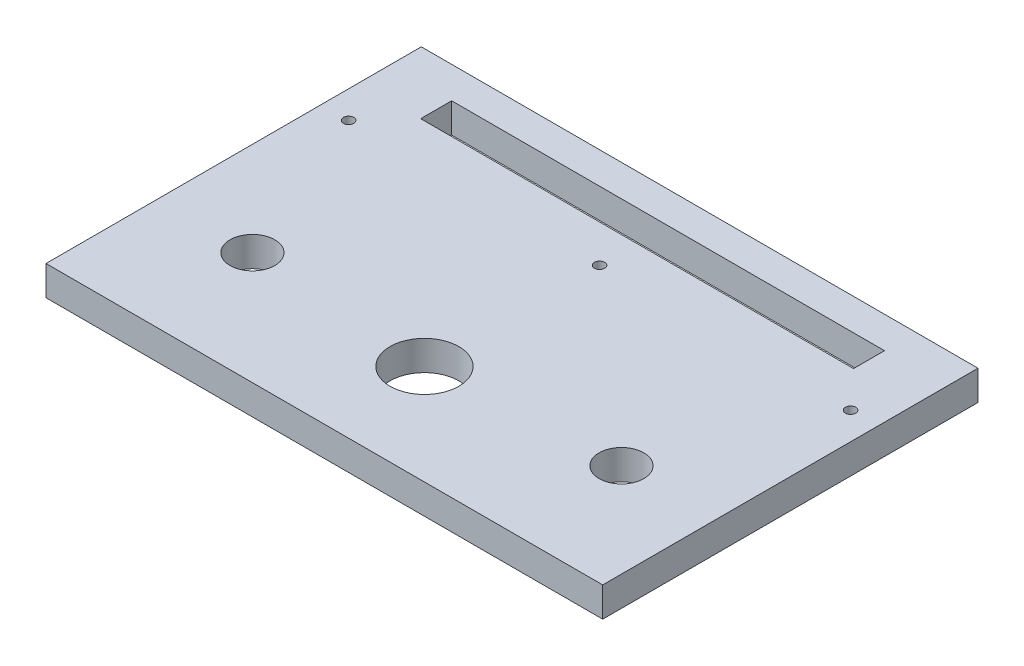
ISO-10303-21;
HEADER;
FILE_DESCRIPTION(('STEP AP214'),'2;1');
FILE_NAME('part.step','',(''),(''),'','','');
FILE_SCHEMA(('AUTOMOTIVE_DESIGN { 1 0 10303 214 1 1 1 1 }'));
ENDSEC;
DATA;
#1=APPLICATION_CONTEXT('core data for automotive mechanical design processes');
#2=APPLICATION_PROTOCOL_DEFINITION('international standard','automotive_design',2000,#1);
#3=PRODUCT_CONTEXT('',#1,'mechanical');
#4=PRODUCT('Part','Part','',(#3));
#5=PRODUCT_RELATED_PRODUCT_CATEGORY('part','',(#4));
#6=PRODUCT_DEFINITION_FORMATION('','',#4);
#7=PRODUCT_DEFINITION_CONTEXT('part definition',#1,'design');
#8=PRODUCT_DEFINITION('design','',#6,#7);
#9=PRODUCT_DEFINITION_SHAPE('','',#8);
#10=(LENGTH_UNIT() NAMED_UNIT(*) SI_UNIT(.MILLI.,.METRE.));
#11=(NAMED_UNIT(*) PLANE_ANGLE_UNIT() SI_UNIT($,.RADIAN.));
#12=(NAMED_UNIT(*) SI_UNIT($,.STERADIAN.) SOLID_ANGLE_UNIT());
#13=UNCERTAINTY_MEASURE_WITH_UNIT(LENGTH_MEASURE(1.E-05),#10,'distance_accuracy_value','');
#14=(GEOMETRIC_REPRESENTATION_CONTEXT(3) GLOBAL_UNCERTAINTY_ASSIGNED_CONTEXT((#13)) GLOBAL_UNIT_ASSIGNED_CONTEXT((#10,
#11,#12)) REPRESENTATION_CONTEXT('',''));
#15=CARTESIAN_POINT('',(0.,0.,0.));
#16=DIRECTION('',(0.,0.,1.));
#17=DIRECTION('',(1.,0.,0.));
#18=AXIS2_PLACEMENT_3D('',#15,#16,#17);
#19=CARTESIAN_POINT('',(0.,9.5,0.));
#20=DIRECTION('',(0.,1.,0.));
#21=DIRECTION('',(0.,0.,1.));
#22=AXIS2_PLACEMENT_3D('',#19,#20,#21);
#23=PLANE('',#22);
#24=CARTESIAN_POINT('',(-80.25,9.5,-28.));
#25=DIRECTION('',(0.,1.,0.));
#26=DIRECTION('',(0.,0.,1.));
#27=AXIS2_PLACEMENT_3D('',#24,#25,#26);
#28=CIRCLE('',#27,1.64999999999998);
#29=CARTESIAN_POINT('',(-80.25,9.5,-26.35));
#30=VERTEX_POINT('',#29);
#31=EDGE_CURVE('E281',#30,#30,#28,.T.);
#32=ORIENTED_EDGE('',*,*,#31,.F.);
#33=EDGE_LOOP('',(#32));
#34=FACE_BOUND('',#33,.T.);
#35=CARTESIAN_POINT('',(0.,9.5,-28.));
#36=DIRECTION('',(0.,1.,0.));
#37=DIRECTION('',(0.,0.,1.));
#38=AXIS2_PLACEMENT_3D('',#35,#36,#37);
#39=CIRCLE('',#38,1.64999999999999);
#40=CARTESIAN_POINT('',(0.,9.5,-26.35));
#41=VERTEX_POINT('',#40);
#42=EDGE_CURVE('E285',#41,#41,#39,.T.);
#43=ORIENTED_EDGE('',*,*,#42,.F.);
#44=EDGE_LOOP('',(#43));
#45=FACE_BOUND('',#44,.T.);
#46=CARTESIAN_POINT('',(80.25,9.5,-28.));
#47=DIRECTION('',(0.,1.,0.));
#48=DIRECTION('',(0.,0.,1.));
#49=AXIS2_PLACEMENT_3D('',#46,#47,#48);
#50=CIRCLE('',#49,1.64999999999998);
#51=CARTESIAN_POINT('',(80.25,9.5,-26.35));
#52=VERTEX_POINT('',#51);
#53=EDGE_CURVE('E295',#52,#52,#50,.T.);
#54=ORIENTED_EDGE('',*,*,#53,.F.);
#55=EDGE_LOOP('',(#54));
#56=FACE_BOUND('',#55,.T.);
#57=CARTESIAN_POINT('',(-59.,9.5,24.));
#58=DIRECTION('',(0.,1.,0.));
#59=DIRECTION('',(0.,0.,1.));
#60=AXIS2_PLACEMENT_3D('',#57,#58,#59);
#61=CIRCLE('',#60,7.15000000000001);
#62=CARTESIAN_POINT('',(-59.,9.5,31.15));
#63=VERTEX_POINT('',#62);
#64=EDGE_CURVE('E312',#63,#63,#61,.T.);
#65=ORIENTED_EDGE('',*,*,#64,.F.);
#66=EDGE_LOOP('',(#65));
#67=FACE_BOUND('',#66,.T.);
#68=DIRECTION('',(-1.,0.,0.));
#69=VECTOR('',#68,1.);
#70=CARTESIAN_POINT('',(69.2,9.5,-49.9));
#71=LINE('',#70,#69);
#72=CARTESIAN_POINT('',(69.2,9.5,-49.9));
#73=VERTEX_POINT('',#72);
#74=CARTESIAN_POINT('',(-69.2,9.5,-49.9));
#75=VERTEX_POINT('',#74);
#76=EDGE_CURVE('E118',#73,#75,#71,.T.);
#77=ORIENTED_EDGE('',*,*,#76,.F.);
#78=DIRECTION('',(0.,0.,-1.));
#79=VECTOR('',#78,1.);
#80=CARTESIAN_POINT('',(69.2,9.5,-40.));
#81=LINE('',#80,#79);
#82=CARTESIAN_POINT('',(69.2,9.5,-40.));
#83=VERTEX_POINT('',#82);
#84=EDGE_CURVE('E109',#83,#73,#81,.T.);
#85=ORIENTED_EDGE('',*,*,#84,.F.);
#86=DIRECTION('',(1.,0.,0.));
#87=VECTOR('',#86,1.);
#88=CARTESIAN_POINT('',(-69.2,9.5,-40.));
#89=LINE('',#88,#87);
#90=CARTESIAN_POINT('',(-69.2,9.5,-40.));
#91=VERTEX_POINT('',#90);
#92=EDGE_CURVE('E136',#91,#83,#89,.T.);
#93=ORIENTED_EDGE('',*,*,#92,.F.);
#94=DIRECTION('',(0.,0.,1.));
#95=VECTOR('',#94,1.);
#96=CARTESIAN_POINT('',(-69.2,9.5,-49.9));
#97=LINE('',#96,#95);
#98=EDGE_CURVE('E132',#75,#91,#97,.T.);
#99=ORIENTED_EDGE('',*,*,#98,.F.);
#100=EDGE_LOOP('',(#77,#85,#93,#99));
#101=FACE_BOUND('',#100,.T.);
#102=DIRECTION('',(0.,0.,-1.));
#103=VECTOR('',#102,1.);
#104=CARTESIAN_POINT('',(89.,9.5,-60.));
#105=LINE('',#104,#103);
#106=CARTESIAN_POINT('',(89.,9.5,60.));
#107=VERTEX_POINT('',#106);
#108=CARTESIAN_POINT('',(89.,9.5,-60.));
#109=VERTEX_POINT('',#108);
#110=EDGE_CURVE('E160',#107,#109,#105,.T.);
#111=ORIENTED_EDGE('',*,*,#110,.T.);
#112=DIRECTION('',(-1.,0.,0.));
#113=VECTOR('',#112,1.);
#114=CARTESIAN_POINT('',(-89.,9.5,-60.));
#115=LINE('',#114,#113);
#116=CARTESIAN_POINT('',(-89.,9.5,-60.));
#117=VERTEX_POINT('',#116);
#118=EDGE_CURVE('E164',#109,#117,#115,.T.);
#119=ORIENTED_EDGE('',*,*,#118,.T.);
#120=DIRECTION('',(0.,0.,1.));
#121=VECTOR('',#120,1.);
#122=CARTESIAN_POINT('',(-89.,9.5,-60.));
#123=LINE('',#122,#121);
#124=CARTESIAN_POINT('',(-89.,9.5,60.));
#125=VERTEX_POINT('',#124);
#126=EDGE_CURVE('E168',#117,#125,#123,.T.);
#127=ORIENTED_EDGE('',*,*,#126,.T.);
#128=DIRECTION('',(1.,0.,0.));
#129=VECTOR('',#128,1.);
#130=CARTESIAN_POINT('',(-89.,9.5,60.));
#131=LINE('',#130,#129);
#132=EDGE_CURVE('E171',#125,#107,#131,.T.);
#133=ORIENTED_EDGE('',*,*,#132,.T.);
#134=EDGE_LOOP('',(#111,#119,#127,#133));
#135=FACE_BOUND('',#134,.T.);
#136=CARTESIAN_POINT('',(0.,9.5,28.));
#137=DIRECTION('',(0.,1.,0.));
#138=DIRECTION('',(0.,0.,1.));
#139=AXIS2_PLACEMENT_3D('',#136,#137,#138);
#140=CIRCLE('',#139,11.);
#141=CARTESIAN_POINT('',(0.,9.5,39.));
#142=VERTEX_POINT('',#141);
#143=EDGE_CURVE('E144',#142,#142,#140,.T.);
#144=ORIENTED_EDGE('',*,*,#143,.F.);
#145=EDGE_LOOP('',(#144));
#146=FACE_BOUND('',#145,.T.);
#147=CARTESIAN_POINT('',(59.,9.5,24.));
#148=DIRECTION('',(0.,1.,0.));
#149=DIRECTION('',(0.,0.,-1.));
#150=AXIS2_PLACEMENT_3D('',#147,#148,#149);
#151=CIRCLE('',#150,7.15000000000001);
#152=CARTESIAN_POINT('',(59.,9.5,16.85));
#153=VERTEX_POINT('',#152);
#154=EDGE_CURVE('E304',#153,#153,#151,.T.);
#155=ORIENTED_EDGE('',*,*,#154,.F.);
#156=EDGE_LOOP('',(#155));
#157=FACE_BOUND('',#156,.T.);
#158=ADVANCED_FACE('F43',(#34,#45,#56,#67,#101,#135,#146,#157),#23,.T.);
#159=CARTESIAN_POINT('',(0.,0.,0.));
#160=DIRECTION('',(0.,1.,0.));
#161=DIRECTION('',(0.,0.,1.));
#162=AXIS2_PLACEMENT_3D('',#159,#160,#161);
#163=PLANE('',#162);
#164=CARTESIAN_POINT('',(-80.25,0.,-28.));
#165=DIRECTION('',(0.,1.,0.));
#166=DIRECTION('',(0.,0.,1.));
#167=AXIS2_PLACEMENT_3D('',#164,#165,#166);
#168=CIRCLE('',#167,1.65);
#169=CARTESIAN_POINT('',(-80.25,0.,-26.35));
#170=VERTEX_POINT('',#169);
#171=EDGE_CURVE('E279',#170,#170,#168,.T.);
#172=ORIENTED_EDGE('',*,*,#171,.T.);
#173=EDGE_LOOP('',(#172));
#174=FACE_BOUND('',#173,.T.);
#175=CARTESIAN_POINT('',(0.,0.,-28.));
#176=DIRECTION('',(0.,1.,0.));
#177=DIRECTION('',(0.,0.,1.));
#178=AXIS2_PLACEMENT_3D('',#175,#176,#177);
#179=CIRCLE('',#178,1.65);
#180=CARTESIAN_POINT('',(0.,0.,-26.35));
#181=VERTEX_POINT('',#180);
#182=EDGE_CURVE('E291',#181,#181,#179,.T.);
#183=ORIENTED_EDGE('',*,*,#182,.T.);
#184=EDGE_LOOP('',(#183));
#185=FACE_BOUND('',#184,.T.);
#186=CARTESIAN_POINT('',(80.25,0.,-28.));
#187=DIRECTION('',(0.,1.,0.));
#188=DIRECTION('',(0.,0.,1.));
#189=AXIS2_PLACEMENT_3D('',#186,#187,#188);
#190=CIRCLE('',#189,1.65);
#191=CARTESIAN_POINT('',(80.25,0.,-26.35));
#192=VERTEX_POINT('',#191);
#193=EDGE_CURVE('E299',#192,#192,#190,.T.);
#194=ORIENTED_EDGE('',*,*,#193,.T.);
#195=EDGE_LOOP('',(#194));
#196=FACE_BOUND('',#195,.T.);
#197=DIRECTION('',(0.,0.,-1.));
#198=VECTOR('',#197,1.);
#199=CARTESIAN_POINT('',(89.,0.,-60.));
#200=LINE('',#199,#198);
#201=CARTESIAN_POINT('',(89.,0.,60.));
#202=VERTEX_POINT('',#201);
#203=CARTESIAN_POINT('',(89.,0.,-60.));
#204=VERTEX_POINT('',#203);
#205=EDGE_CURVE('E127',#202,#204,#200,.T.);
#206=ORIENTED_EDGE('',*,*,#205,.F.);
#207=DIRECTION('',(1.,0.,0.));
#208=VECTOR('',#207,1.);
#209=CARTESIAN_POINT('',(-89.,0.,60.));
#210=LINE('',#209,#208);
#211=CARTESIAN_POINT('',(-89.,0.,60.));
#212=VERTEX_POINT('',#211);
#213=EDGE_CURVE('E165',#212,#202,#210,.T.);
#214=ORIENTED_EDGE('',*,*,#213,.F.);
#215=DIRECTION('',(0.,0.,1.));
#216=VECTOR('',#215,1.);
#217=CARTESIAN_POINT('',(-89.,0.,-60.));
#218=LINE('',#217,#216);
#219=CARTESIAN_POINT('',(-89.,0.,-60.));
#220=VERTEX_POINT('',#219);
#221=EDGE_CURVE('E181',#220,#212,#218,.T.);
#222=ORIENTED_EDGE('',*,*,#221,.F.);
#223=DIRECTION('',(-1.,0.,0.));
#224=VECTOR('',#223,1.);
#225=CARTESIAN_POINT('',(-89.,0.,-60.));
#226=LINE('',#225,#224);
#227=EDGE_CURVE('E178',#204,#220,#226,.T.);
#228=ORIENTED_EDGE('',*,*,#227,.F.);
#229=EDGE_LOOP('',(#206,#214,#222,#228));
#230=FACE_BOUND('',#229,.T.);
#231=DIRECTION('',(0.,0.,-1.));
#232=VECTOR('',#231,1.);
#233=CARTESIAN_POINT('',(69.2,0.,-40.));
#234=LINE('',#233,#232);
#235=CARTESIAN_POINT('',(69.2,0.,-40.));
#236=VERTEX_POINT('',#235);
#237=CARTESIAN_POINT('',(69.2,0.,-49.9));
#238=VERTEX_POINT('',#237);
#239=EDGE_CURVE('E67',#236,#238,#234,.T.);
#240=ORIENTED_EDGE('',*,*,#239,.T.);
#241=DIRECTION('',(-1.,0.,0.));
#242=VECTOR('',#241,1.);
#243=CARTESIAN_POINT('',(69.2,0.,-49.9));
#244=LINE('',#243,#242);
#245=CARTESIAN_POINT('',(-69.2,0.,-49.9));
#246=VERTEX_POINT('',#245);
#247=EDGE_CURVE('E125',#238,#246,#244,.T.);
#248=ORIENTED_EDGE('',*,*,#247,.T.);
#249=DIRECTION('',(0.,0.,1.));
#250=VECTOR('',#249,1.);
#251=CARTESIAN_POINT('',(-69.2,0.,-49.9));
#252=LINE('',#251,#250);
#253=CARTESIAN_POINT('',(-69.2,0.,-40.));
#254=VERTEX_POINT('',#253);
#255=EDGE_CURVE('E147',#246,#254,#252,.T.);
#256=ORIENTED_EDGE('',*,*,#255,.T.);
#257=DIRECTION('',(1.,0.,0.));
#258=VECTOR('',#257,1.);
#259=CARTESIAN_POINT('',(-69.2,0.,-40.));
#260=LINE('',#259,#258);
#261=EDGE_CURVE('E119',#254,#236,#260,.T.);
#262=ORIENTED_EDGE('',*,*,#261,.T.);
#263=EDGE_LOOP('',(#240,#248,#256,#262));
#264=FACE_BOUND('',#263,.T.);
#265=CARTESIAN_POINT('',(0.,0.,28.));
#266=DIRECTION('',(0.,1.,0.));
#267=DIRECTION('',(0.,0.,1.));
#268=AXIS2_PLACEMENT_3D('',#265,#266,#267);
#269=CIRCLE('',#268,11.);
#270=CARTESIAN_POINT('',(0.,0.,39.));
#271=VERTEX_POINT('',#270);
#272=EDGE_CURVE('E316',#271,#271,#269,.T.);
#273=ORIENTED_EDGE('',*,*,#272,.T.);
#274=EDGE_LOOP('',(#273));
#275=FACE_BOUND('',#274,.T.);
#276=CARTESIAN_POINT('',(-59.,0.,24.));
#277=DIRECTION('',(0.,1.,0.));
#278=DIRECTION('',(0.,0.,1.));
#279=AXIS2_PLACEMENT_3D('',#276,#277,#278);
#280=CIRCLE('',#279,7.15000000000001);
#281=CARTESIAN_POINT('',(-59.,0.,31.15));
#282=VERTEX_POINT('',#281);
#283=EDGE_CURVE('E308',#282,#282,#280,.T.);
#284=ORIENTED_EDGE('',*,*,#283,.T.);
#285=EDGE_LOOP('',(#284));
#286=FACE_BOUND('',#285,.T.);
#287=CARTESIAN_POINT('',(59.,0.,24.));
#288=DIRECTION('',(0.,1.,0.));
#289=DIRECTION('',(0.,0.,-1.));
#290=AXIS2_PLACEMENT_3D('',#287,#288,#289);
#291=CIRCLE('',#290,7.15000000000001);
#292=CARTESIAN_POINT('',(59.,0.,16.85));
#293=VERTEX_POINT('',#292);
#294=EDGE_CURVE('E303',#293,#293,#291,.T.);
#295=ORIENTED_EDGE('',*,*,#294,.T.);
#296=EDGE_LOOP('',(#295));
#297=FACE_BOUND('',#296,.T.);
#298=ADVANCED_FACE('F204',(#174,#185,#196,#230,#264,#275,#286,#297),#163,.F.);
#299=CARTESIAN_POINT('',(89.,9.5,-60.));
#300=DIRECTION('',(-1.,0.,0.));
#301=DIRECTION('',(0.,0.,1.));
#302=AXIS2_PLACEMENT_3D('',#299,#300,#301);
#303=PLANE('',#302);
#304=ORIENTED_EDGE('',*,*,#205,.T.);
#305=DIRECTION('',(0.,-1.,0.));
#306=VECTOR('',#305,1.);
#307=CARTESIAN_POINT('',(89.,9.5,-60.));
#308=LINE('',#307,#306);
#309=EDGE_CURVE('E11',#109,#204,#308,.T.);
#310=ORIENTED_EDGE('',*,*,#309,.F.);
#311=ORIENTED_EDGE('',*,*,#110,.F.);
#312=DIRECTION('',(0.,-1.,0.));
#313=VECTOR('',#312,1.);
#314=CARTESIAN_POINT('',(89.,9.5,60.));
#315=LINE('',#314,#313);
#316=EDGE_CURVE('E174',#107,#202,#315,.T.);
#317=ORIENTED_EDGE('',*,*,#316,.T.);
#318=EDGE_LOOP('',(#304,#310,#311,#317));
#319=FACE_BOUND('',#318,.T.);
#320=ADVANCED_FACE('F45',(#319),#303,.F.);
#321=CARTESIAN_POINT('',(-89.,9.5,-60.));
#322=DIRECTION('',(0.,0.,1.));
#323=DIRECTION('',(1.,0.,0.));
#324=AXIS2_PLACEMENT_3D('',#321,#322,#323);
#325=PLANE('',#324);
#326=ORIENTED_EDGE('',*,*,#227,.T.);
#327=DIRECTION('',(0.,-1.,0.));
#328=VECTOR('',#327,1.);
#329=CARTESIAN_POINT('',(-89.,9.5,-60.));
#330=LINE('',#329,#328);
#331=EDGE_CURVE('E52',#117,#220,#330,.T.);
#332=ORIENTED_EDGE('',*,*,#331,.F.);
#333=ORIENTED_EDGE('',*,*,#118,.F.);
#334=ORIENTED_EDGE('',*,*,#309,.T.);
#335=EDGE_LOOP('',(#326,#332,#333,#334));
#336=FACE_BOUND('',#335,.T.);
#337=ADVANCED_FACE('F214',(#336),#325,.F.);
#338=CARTESIAN_POINT('',(-89.,9.5,-60.));
#339=DIRECTION('',(1.,0.,0.));
#340=DIRECTION('',(0.,0.,-1.));
#341=AXIS2_PLACEMENT_3D('',#338,#339,#340);
#342=PLANE('',#341);
#343=ORIENTED_EDGE('',*,*,#221,.T.);
#344=DIRECTION('',(0.,-1.,0.));
#345=VECTOR('',#344,1.);
#346=CARTESIAN_POINT('',(-89.,9.5,60.));
#347=LINE('',#346,#345);
#348=EDGE_CURVE('E189',#125,#212,#347,.T.);
#349=ORIENTED_EDGE('',*,*,#348,.F.);
#350=ORIENTED_EDGE('',*,*,#126,.F.);
#351=ORIENTED_EDGE('',*,*,#331,.T.);
#352=EDGE_LOOP('',(#343,#349,#350,#351));
#353=FACE_BOUND('',#352,.T.);
#354=ADVANCED_FACE('F198',(#353),#342,.F.);
#355=CARTESIAN_POINT('',(-89.,9.5,60.));
#356=DIRECTION('',(0.,0.,-1.));
#357=DIRECTION('',(-1.,0.,0.));
#358=AXIS2_PLACEMENT_3D('',#355,#356,#357);
#359=PLANE('',#358);
#360=ORIENTED_EDGE('',*,*,#213,.T.);
#361=ORIENTED_EDGE('',*,*,#316,.F.);
#362=ORIENTED_EDGE('',*,*,#132,.F.);
#363=ORIENTED_EDGE('',*,*,#348,.T.);
#364=EDGE_LOOP('',(#360,#361,#362,#363));
#365=FACE_BOUND('',#364,.T.);
#366=ADVANCED_FACE('F208',(#365),#359,.F.);
#367=CARTESIAN_POINT('',(69.2,9.5,-40.));
#368=DIRECTION('',(-1.,0.,0.));
#369=DIRECTION('',(0.,0.,1.));
#370=AXIS2_PLACEMENT_3D('',#367,#368,#369);
#371=PLANE('',#370);
#372=ORIENTED_EDGE('',*,*,#239,.F.);
#373=DIRECTION('',(0.,-1.,0.));
#374=VECTOR('',#373,1.);
#375=CARTESIAN_POINT('',(69.2,9.5,-40.));
#376=LINE('',#375,#374);
#377=EDGE_CURVE('E113',#83,#236,#376,.T.);
#378=ORIENTED_EDGE('',*,*,#377,.F.);
#379=ORIENTED_EDGE('',*,*,#84,.T.);
#380=DIRECTION('',(0.,-1.,0.));
#381=VECTOR('',#380,1.);
#382=CARTESIAN_POINT('',(69.2,9.5,-49.9));
#383=LINE('',#382,#381);
#384=EDGE_CURVE('E112',#73,#238,#383,.T.);
#385=ORIENTED_EDGE('',*,*,#384,.T.);
#386=EDGE_LOOP('',(#372,#378,#379,#385));
#387=FACE_BOUND('',#386,.T.);
#388=ADVANCED_FACE('F111',(#387),#371,.T.);
#389=CARTESIAN_POINT('',(69.2,9.5,-49.9));
#390=DIRECTION('',(0.,0.,1.));
#391=DIRECTION('',(1.,0.,0.));
#392=AXIS2_PLACEMENT_3D('',#389,#390,#391);
#393=PLANE('',#392);
#394=ORIENTED_EDGE('',*,*,#247,.F.);
#395=ORIENTED_EDGE('',*,*,#384,.F.);
#396=ORIENTED_EDGE('',*,*,#76,.T.);
#397=DIRECTION('',(0.,-1.,0.));
#398=VECTOR('',#397,1.);
#399=CARTESIAN_POINT('',(-69.2,9.5,-49.9));
#400=LINE('',#399,#398);
#401=EDGE_CURVE('E128',#75,#246,#400,.T.);
#402=ORIENTED_EDGE('',*,*,#401,.T.);
#403=EDGE_LOOP('',(#394,#395,#396,#402));
#404=FACE_BOUND('',#403,.T.);
#405=ADVANCED_FACE('F122',(#404),#393,.T.);
#406=CARTESIAN_POINT('',(-69.2,9.5,-49.9));
#407=DIRECTION('',(1.,0.,0.));
#408=DIRECTION('',(0.,0.,-1.));
#409=AXIS2_PLACEMENT_3D('',#406,#407,#408);
#410=PLANE('',#409);
#411=ORIENTED_EDGE('',*,*,#255,.F.);
#412=ORIENTED_EDGE('',*,*,#401,.F.);
#413=ORIENTED_EDGE('',*,*,#98,.T.);
#414=DIRECTION('',(0.,-1.,0.));
#415=VECTOR('',#414,1.);
#416=CARTESIAN_POINT('',(-69.2,9.5,-40.));
#417=LINE('',#416,#415);
#418=EDGE_CURVE('E59',#91,#254,#417,.T.);
#419=ORIENTED_EDGE('',*,*,#418,.T.);
#420=EDGE_LOOP('',(#411,#412,#413,#419));
#421=FACE_BOUND('',#420,.T.);
#422=ADVANCED_FACE('F241',(#421),#410,.T.);
#423=CARTESIAN_POINT('',(-69.2,9.5,-40.));
#424=DIRECTION('',(0.,0.,-1.));
#425=DIRECTION('',(-1.,0.,0.));
#426=AXIS2_PLACEMENT_3D('',#423,#424,#425);
#427=PLANE('',#426);
#428=ORIENTED_EDGE('',*,*,#261,.F.);
#429=ORIENTED_EDGE('',*,*,#418,.F.);
#430=ORIENTED_EDGE('',*,*,#92,.T.);
#431=ORIENTED_EDGE('',*,*,#377,.T.);
#432=EDGE_LOOP('',(#428,#429,#430,#431));
#433=FACE_BOUND('',#432,.T.);
#434=ADVANCED_FACE('F245',(#433),#427,.T.);
#435=CARTESIAN_POINT('',(0.,9.5,28.));
#436=DIRECTION('',(0.,-1.,0.));
#437=DIRECTION('',(0.,0.,-1.));
#438=AXIS2_PLACEMENT_3D('',#435,#436,#437);
#439=CYLINDRICAL_SURFACE('',#438,11.);
#440=ORIENTED_EDGE('',*,*,#143,.T.);
#441=EDGE_LOOP('',(#440));
#442=FACE_BOUND('',#441,.T.);
#443=ORIENTED_EDGE('',*,*,#272,.F.);
#444=EDGE_LOOP('',(#443));
#445=FACE_BOUND('',#444,.T.);
#446=ADVANCED_FACE('F251',(#442,#445),#439,.F.);
#447=CARTESIAN_POINT('',(-59.,9.5,24.));
#448=DIRECTION('',(0.,-1.,0.));
#449=DIRECTION('',(0.,0.,-1.));
#450=AXIS2_PLACEMENT_3D('',#447,#448,#449);
#451=CYLINDRICAL_SURFACE('',#450,7.15000000000001);
#452=ORIENTED_EDGE('',*,*,#64,.T.);
#453=EDGE_LOOP('',(#452));
#454=FACE_BOUND('',#453,.T.);
#455=ORIENTED_EDGE('',*,*,#283,.F.);
#456=EDGE_LOOP('',(#455));
#457=FACE_BOUND('',#456,.T.);
#458=ADVANCED_FACE('F254',(#454,#457),#451,.F.);
#459=CARTESIAN_POINT('',(59.,9.5,24.));
#460=DIRECTION('',(0.,-1.,0.));
#461=DIRECTION('',(0.,0.,-1.));
#462=AXIS2_PLACEMENT_3D('',#459,#460,#461);
#463=CYLINDRICAL_SURFACE('',#462,7.15000000000001);
#464=ORIENTED_EDGE('',*,*,#154,.T.);
#465=EDGE_LOOP('',(#464));
#466=FACE_BOUND('',#465,.T.);
#467=ORIENTED_EDGE('',*,*,#294,.F.);
#468=EDGE_LOOP('',(#467));
#469=FACE_BOUND('',#468,.T.);
#470=ADVANCED_FACE('F258',(#466,#469),#463,.F.);
#471=CARTESIAN_POINT('',(80.25,9.5,-28.));
#472=DIRECTION('',(0.,1.,0.));
#473=DIRECTION('',(0.,0.,1.));
#474=AXIS2_PLACEMENT_3D('',#471,#472,#473);
#475=CYLINDRICAL_SURFACE('',#474,1.64999999999999);
#476=ORIENTED_EDGE('',*,*,#193,.F.);
#477=EDGE_LOOP('',(#476));
#478=FACE_BOUND('',#477,.T.);
#479=ORIENTED_EDGE('',*,*,#53,.T.);
#480=EDGE_LOOP('',(#479));
#481=FACE_BOUND('',#480,.T.);
#482=ADVANCED_FACE('F262',(#478,#481),#475,.F.);
#483=CARTESIAN_POINT('',(0.,9.5,-28.));
#484=DIRECTION('',(0.,1.,0.));
#485=DIRECTION('',(0.,0.,1.));
#486=AXIS2_PLACEMENT_3D('',#483,#484,#485);
#487=CYLINDRICAL_SURFACE('',#486,1.64999999999999);
#488=ORIENTED_EDGE('',*,*,#182,.F.);
#489=EDGE_LOOP('',(#488));
#490=FACE_BOUND('',#489,.T.);
#491=ORIENTED_EDGE('',*,*,#42,.T.);
#492=EDGE_LOOP('',(#491));
#493=FACE_BOUND('',#492,.T.);
#494=ADVANCED_FACE('F266',(#490,#493),#487,.F.);
#495=CARTESIAN_POINT('',(-80.25,9.5,-28.));
#496=DIRECTION('',(0.,1.,0.));
#497=DIRECTION('',(0.,0.,1.));
#498=AXIS2_PLACEMENT_3D('',#495,#496,#497);
#499=CYLINDRICAL_SURFACE('',#498,1.64999999999999);
#500=ORIENTED_EDGE('',*,*,#171,.F.);
#501=EDGE_LOOP('',(#500));
#502=FACE_BOUND('',#501,.T.);
#503=ORIENTED_EDGE('',*,*,#31,.T.);
#504=EDGE_LOOP('',(#503));
#505=FACE_BOUND('',#504,.T.);
#506=ADVANCED_FACE('F270',(#502,#505),#499,.F.);
#507=CLOSED_SHELL('',(#158,#298,#320,#337,#354,#366,#388,#405,#422,#434,#446,#458,#470,#482,
#494,#506));
#508=MANIFOLD_SOLID_BREP('B2',#507);
#509=ADVANCED_BREP_SHAPE_REPRESENTATION('',(#18,#508),#14);
#510=SHAPE_DEFINITION_REPRESENTATION(#9,#509);
ENDSEC;
END-ISO-10303-21;
